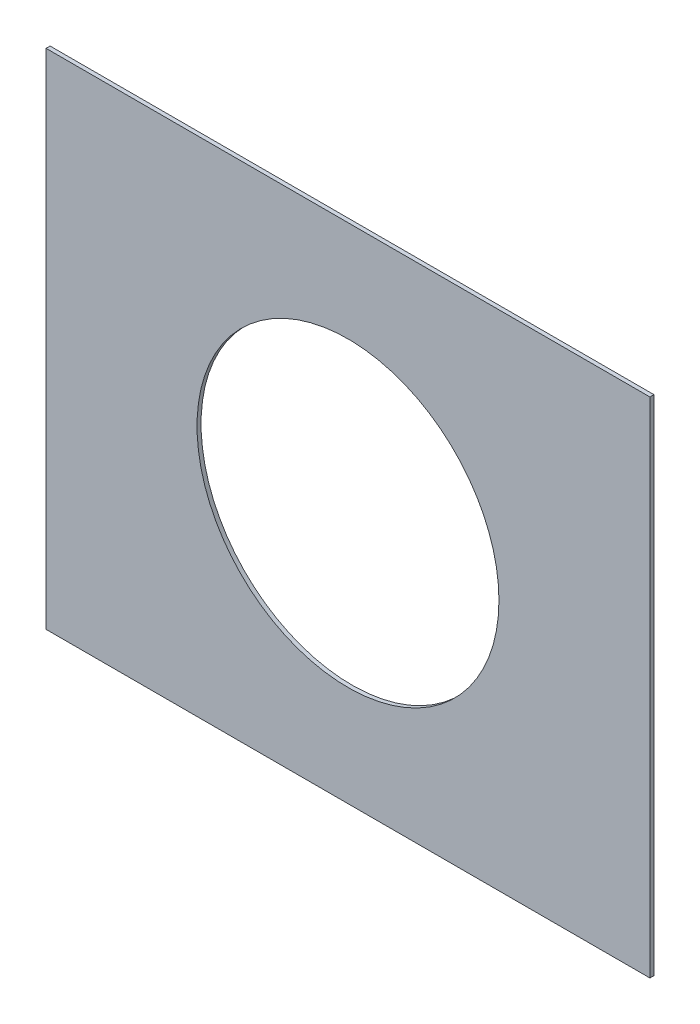
ISO-10303-21;
HEADER;
FILE_DESCRIPTION(('STEP AP214'),'2;1');
FILE_NAME('part.step','',(''),(''),'','','');
FILE_SCHEMA(('AUTOMOTIVE_DESIGN { 1 0 10303 214 1 1 1 1 }'));
ENDSEC;
DATA;
#1=APPLICATION_CONTEXT('core data for automotive mechanical design processes');
#2=APPLICATION_PROTOCOL_DEFINITION('international standard','automotive_design',2000,#1);
#3=PRODUCT_CONTEXT('',#1,'mechanical');
#4=PRODUCT('Part','Part','',(#3));
#5=PRODUCT_RELATED_PRODUCT_CATEGORY('part','',(#4));
#6=PRODUCT_DEFINITION_FORMATION('','',#4);
#7=PRODUCT_DEFINITION_CONTEXT('part definition',#1,'design');
#8=PRODUCT_DEFINITION('design','',#6,#7);
#9=PRODUCT_DEFINITION_SHAPE('','',#8);
#10=(LENGTH_UNIT() NAMED_UNIT(*) SI_UNIT(.MILLI.,.METRE.));
#11=(NAMED_UNIT(*) PLANE_ANGLE_UNIT() SI_UNIT($,.RADIAN.));
#12=(NAMED_UNIT(*) SI_UNIT($,.STERADIAN.) SOLID_ANGLE_UNIT());
#13=UNCERTAINTY_MEASURE_WITH_UNIT(LENGTH_MEASURE(1.E-05),#10,'distance_accuracy_value','');
#14=(GEOMETRIC_REPRESENTATION_CONTEXT(3) GLOBAL_UNCERTAINTY_ASSIGNED_CONTEXT((#13)) GLOBAL_UNIT_ASSIGNED_CONTEXT((#10,
#11,#12)) REPRESENTATION_CONTEXT('',''));
#15=CARTESIAN_POINT('',(0.,0.,0.));
#16=DIRECTION('',(0.,0.,1.));
#17=DIRECTION('',(1.,0.,0.));
#18=AXIS2_PLACEMENT_3D('',#15,#16,#17);
#19=CARTESIAN_POINT('',(0.,0.,2.));
#20=DIRECTION('',(0.,0.,1.));
#21=DIRECTION('',(1.,0.,0.));
#22=AXIS2_PLACEMENT_3D('',#19,#20,#21);
#23=PLANE('',#22);
#24=DIRECTION('',(0.,-1.,0.));
#25=VECTOR('',#24,1.);
#26=CARTESIAN_POINT('',(-150.,125.,2.));
#27=LINE('',#26,#25);
#28=CARTESIAN_POINT('',(-150.,125.,2.));
#29=VERTEX_POINT('',#28);
#30=CARTESIAN_POINT('',(-150.,-125.,2.));
#31=VERTEX_POINT('',#30);
#32=EDGE_CURVE('E94',#29,#31,#27,.T.);
#33=ORIENTED_EDGE('',*,*,#32,.T.);
#34=DIRECTION('',(1.,0.,0.));
#35=VECTOR('',#34,1.);
#36=CARTESIAN_POINT('',(-150.,-125.,2.));
#37=LINE('',#36,#35);
#38=CARTESIAN_POINT('',(150.,-125.,2.));
#39=VERTEX_POINT('',#38);
#40=EDGE_CURVE('E89',#31,#39,#37,.T.);
#41=ORIENTED_EDGE('',*,*,#40,.T.);
#42=DIRECTION('',(0.,1.,0.));
#43=VECTOR('',#42,1.);
#44=CARTESIAN_POINT('',(150.,125.,2.));
#45=LINE('',#44,#43);
#46=CARTESIAN_POINT('',(150.,125.,2.));
#47=VERTEX_POINT('',#46);
#48=EDGE_CURVE('E92',#39,#47,#45,.T.);
#49=ORIENTED_EDGE('',*,*,#48,.T.);
#50=DIRECTION('',(-1.,0.,0.));
#51=VECTOR('',#50,1.);
#52=CARTESIAN_POINT('',(-150.,125.,2.));
#53=LINE('',#52,#51);
#54=EDGE_CURVE('E59',#47,#29,#53,.T.);
#55=ORIENTED_EDGE('',*,*,#54,.T.);
#56=EDGE_LOOP('',(#33,#41,#49,#55));
#57=FACE_BOUND('',#56,.T.);
#58=CARTESIAN_POINT('',(0.,0.,2.));
#59=DIRECTION('',(0.,0.,1.));
#60=DIRECTION('',(1.,0.,0.));
#61=AXIS2_PLACEMENT_3D('',#58,#59,#60);
#62=CIRCLE('',#61,75.);
#63=CARTESIAN_POINT('',(75.,0.,2.));
#64=VERTEX_POINT('',#63);
#65=EDGE_CURVE('E109',#64,#64,#62,.T.);
#66=ORIENTED_EDGE('',*,*,#65,.F.);
#67=EDGE_LOOP('',(#66));
#68=FACE_BOUND('',#67,.T.);
#69=ADVANCED_FACE('F42',(#57,#68),#23,.T.);
#70=CARTESIAN_POINT('',(0.,0.,0.));
#71=DIRECTION('',(0.,0.,1.));
#72=DIRECTION('',(1.,0.,0.));
#73=AXIS2_PLACEMENT_3D('',#70,#71,#72);
#74=PLANE('',#73);
#75=DIRECTION('',(0.,-1.,0.));
#76=VECTOR('',#75,1.);
#77=CARTESIAN_POINT('',(-150.,125.,0.));
#78=LINE('',#77,#76);
#79=CARTESIAN_POINT('',(-150.,125.,0.));
#80=VERTEX_POINT('',#79);
#81=CARTESIAN_POINT('',(-150.,-125.,0.));
#82=VERTEX_POINT('',#81);
#83=EDGE_CURVE('E106',#80,#82,#78,.T.);
#84=ORIENTED_EDGE('',*,*,#83,.F.);
#85=DIRECTION('',(-1.,0.,0.));
#86=VECTOR('',#85,1.);
#87=CARTESIAN_POINT('',(-150.,125.,0.));
#88=LINE('',#87,#86);
#89=CARTESIAN_POINT('',(150.,125.,0.));
#90=VERTEX_POINT('',#89);
#91=EDGE_CURVE('E82',#90,#80,#88,.T.);
#92=ORIENTED_EDGE('',*,*,#91,.F.);
#93=DIRECTION('',(0.,1.,0.));
#94=VECTOR('',#93,1.);
#95=CARTESIAN_POINT('',(150.,125.,0.));
#96=LINE('',#95,#94);
#97=CARTESIAN_POINT('',(150.,-125.,0.));
#98=VERTEX_POINT('',#97);
#99=EDGE_CURVE('E76',#98,#90,#96,.T.);
#100=ORIENTED_EDGE('',*,*,#99,.F.);
#101=DIRECTION('',(1.,0.,0.));
#102=VECTOR('',#101,1.);
#103=CARTESIAN_POINT('',(-150.,-125.,0.));
#104=LINE('',#103,#102);
#105=EDGE_CURVE('E98',#82,#98,#104,.T.);
#106=ORIENTED_EDGE('',*,*,#105,.F.);
#107=EDGE_LOOP('',(#84,#92,#100,#106));
#108=FACE_BOUND('',#107,.T.);
#109=CARTESIAN_POINT('',(0.,0.,0.));
#110=DIRECTION('',(0.,0.,1.));
#111=DIRECTION('',(1.,0.,0.));
#112=AXIS2_PLACEMENT_3D('',#109,#110,#111);
#113=CIRCLE('',#112,75.);
#114=CARTESIAN_POINT('',(75.,0.,0.));
#115=VERTEX_POINT('',#114);
#116=EDGE_CURVE('E121',#115,#115,#113,.T.);
#117=ORIENTED_EDGE('',*,*,#116,.T.);
#118=EDGE_LOOP('',(#117));
#119=FACE_BOUND('',#118,.T.);
#120=ADVANCED_FACE('F117',(#108,#119),#74,.F.);
#121=CARTESIAN_POINT('',(-150.,125.,2.));
#122=DIRECTION('',(1.,0.,0.));
#123=DIRECTION('',(0.,0.,-1.));
#124=AXIS2_PLACEMENT_3D('',#121,#122,#123);
#125=PLANE('',#124);
#126=ORIENTED_EDGE('',*,*,#83,.T.);
#127=DIRECTION('',(0.,0.,-1.));
#128=VECTOR('',#127,1.);
#129=CARTESIAN_POINT('',(-150.,-125.,2.));
#130=LINE('',#129,#128);
#131=EDGE_CURVE('E13',#31,#82,#130,.T.);
#132=ORIENTED_EDGE('',*,*,#131,.F.);
#133=ORIENTED_EDGE('',*,*,#32,.F.);
#134=DIRECTION('',(0.,0.,-1.));
#135=VECTOR('',#134,1.);
#136=CARTESIAN_POINT('',(-150.,125.,2.));
#137=LINE('',#136,#135);
#138=EDGE_CURVE('E102',#29,#80,#137,.T.);
#139=ORIENTED_EDGE('',*,*,#138,.T.);
#140=EDGE_LOOP('',(#126,#132,#133,#139));
#141=FACE_BOUND('',#140,.T.);
#142=ADVANCED_FACE('F44',(#141),#125,.F.);
#143=CARTESIAN_POINT('',(-150.,-125.,2.));
#144=DIRECTION('',(0.,1.,0.));
#145=DIRECTION('',(0.,0.,1.));
#146=AXIS2_PLACEMENT_3D('',#143,#144,#145);
#147=PLANE('',#146);
#148=ORIENTED_EDGE('',*,*,#105,.T.);
#149=DIRECTION('',(0.,0.,-1.));
#150=VECTOR('',#149,1.);
#151=CARTESIAN_POINT('',(150.,-125.,2.));
#152=LINE('',#151,#150);
#153=EDGE_CURVE('E51',#39,#98,#152,.T.);
#154=ORIENTED_EDGE('',*,*,#153,.F.);
#155=ORIENTED_EDGE('',*,*,#40,.F.);
#156=ORIENTED_EDGE('',*,*,#131,.T.);
#157=EDGE_LOOP('',(#148,#154,#155,#156));
#158=FACE_BOUND('',#157,.T.);
#159=ADVANCED_FACE('F97',(#158),#147,.F.);
#160=CARTESIAN_POINT('',(150.,125.,2.));
#161=DIRECTION('',(-1.,0.,0.));
#162=DIRECTION('',(0.,0.,1.));
#163=AXIS2_PLACEMENT_3D('',#160,#161,#162);
#164=PLANE('',#163);
#165=ORIENTED_EDGE('',*,*,#99,.T.);
#166=DIRECTION('',(0.,0.,-1.));
#167=VECTOR('',#166,1.);
#168=CARTESIAN_POINT('',(150.,125.,2.));
#169=LINE('',#168,#167);
#170=EDGE_CURVE('E99',#47,#90,#169,.T.);
#171=ORIENTED_EDGE('',*,*,#170,.F.);
#172=ORIENTED_EDGE('',*,*,#48,.F.);
#173=ORIENTED_EDGE('',*,*,#153,.T.);
#174=EDGE_LOOP('',(#165,#171,#172,#173));
#175=FACE_BOUND('',#174,.T.);
#176=ADVANCED_FACE('F100',(#175),#164,.F.);
#177=CARTESIAN_POINT('',(-150.,125.,2.));
#178=DIRECTION('',(0.,-1.,0.));
#179=DIRECTION('',(0.,0.,-1.));
#180=AXIS2_PLACEMENT_3D('',#177,#178,#179);
#181=PLANE('',#180);
#182=ORIENTED_EDGE('',*,*,#91,.T.);
#183=ORIENTED_EDGE('',*,*,#138,.F.);
#184=ORIENTED_EDGE('',*,*,#54,.F.);
#185=ORIENTED_EDGE('',*,*,#170,.T.);
#186=EDGE_LOOP('',(#182,#183,#184,#185));
#187=FACE_BOUND('',#186,.T.);
#188=ADVANCED_FACE('F114',(#187),#181,.F.);
#189=CARTESIAN_POINT('',(0.,0.,2.));
#190=DIRECTION('',(0.,0.,-1.));
#191=DIRECTION('',(-1.,0.,0.));
#192=AXIS2_PLACEMENT_3D('',#189,#190,#191);
#193=CYLINDRICAL_SURFACE('',#192,75.);
#194=ORIENTED_EDGE('',*,*,#65,.T.);
#195=EDGE_LOOP('',(#194));
#196=FACE_BOUND('',#195,.T.);
#197=ORIENTED_EDGE('',*,*,#116,.F.);
#198=EDGE_LOOP('',(#197));
#199=FACE_BOUND('',#198,.T.);
#200=ADVANCED_FACE('F127',(#196,#199),#193,.F.);
#201=CLOSED_SHELL('',(#69,#120,#142,#159,#176,#188,#200));
#202=MANIFOLD_SOLID_BREP('B2',#201);
#203=ADVANCED_BREP_SHAPE_REPRESENTATION('',(#18,#202),#14);
#204=SHAPE_DEFINITION_REPRESENTATION(#9,#203);
ENDSEC;
END-ISO-10303-21;
